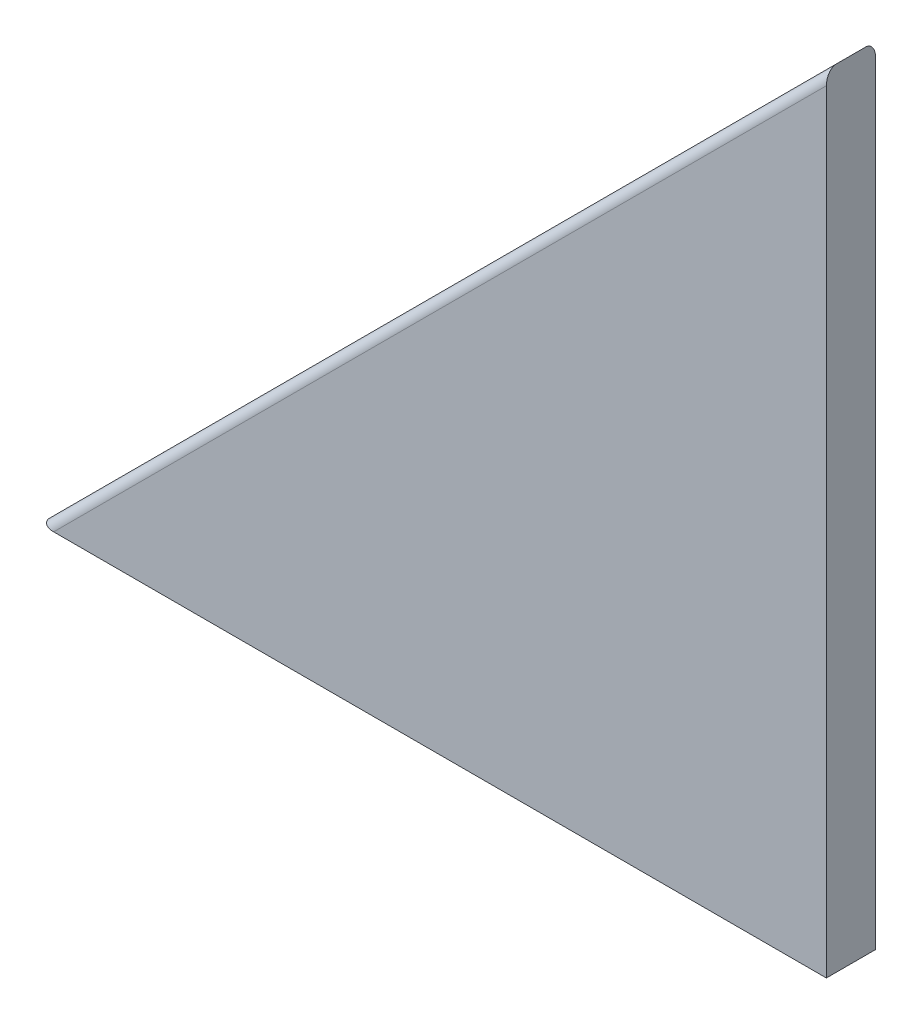
ISO-10303-21;
HEADER;
FILE_DESCRIPTION(('STEP AP214'),'2;1');
FILE_NAME('part.step','',(''),(''),'','','');
FILE_SCHEMA(('AUTOMOTIVE_DESIGN { 1 0 10303 214 1 1 1 1 }'));
ENDSEC;
DATA;
#1=APPLICATION_CONTEXT('core data for automotive mechanical design processes');
#2=APPLICATION_PROTOCOL_DEFINITION('international standard','automotive_design',2000,#1);
#3=PRODUCT_CONTEXT('',#1,'mechanical');
#4=PRODUCT('Part','Part','',(#3));
#5=PRODUCT_RELATED_PRODUCT_CATEGORY('part','',(#4));
#6=PRODUCT_DEFINITION_FORMATION('','',#4);
#7=PRODUCT_DEFINITION_CONTEXT('part definition',#1,'design');
#8=PRODUCT_DEFINITION('design','',#6,#7);
#9=PRODUCT_DEFINITION_SHAPE('','',#8);
#10=(LENGTH_UNIT() NAMED_UNIT(*) SI_UNIT(.MILLI.,.METRE.));
#11=(NAMED_UNIT(*) PLANE_ANGLE_UNIT() SI_UNIT($,.RADIAN.));
#12=(NAMED_UNIT(*) SI_UNIT($,.STERADIAN.) SOLID_ANGLE_UNIT());
#13=UNCERTAINTY_MEASURE_WITH_UNIT(LENGTH_MEASURE(1.E-05),#10,'distance_accuracy_value','');
#14=(GEOMETRIC_REPRESENTATION_CONTEXT(3) GLOBAL_UNCERTAINTY_ASSIGNED_CONTEXT((#13)) GLOBAL_UNIT_ASSIGNED_CONTEXT((#10,
#11,#12)) REPRESENTATION_CONTEXT('',''));
#15=CARTESIAN_POINT('',(0.,0.,0.));
#16=DIRECTION('',(0.,0.,1.));
#17=DIRECTION('',(1.,0.,0.));
#18=AXIS2_PLACEMENT_3D('',#15,#16,#17);
#19=CARTESIAN_POINT('',(0.,101.6,6.35));
#20=DIRECTION('',(-1.,0.,0.));
#21=DIRECTION('',(0.,0.,1.));
#22=AXIS2_PLACEMENT_3D('',#19,#20,#21);
#23=PLANE('',#22);
#24=DIRECTION('',(0.,1.,0.));
#25=VECTOR('',#24,1.);
#26=CARTESIAN_POINT('',(0.,101.6,0.));
#27=LINE('',#26,#25);
#28=CARTESIAN_POINT('',(0.,0.,0.));
#29=VERTEX_POINT('',#28);
#30=CARTESIAN_POINT('',(0.,99.8039487757862,0.));
#31=VERTEX_POINT('',#30);
#32=EDGE_CURVE('E123',#29,#31,#27,.T.);
#33=ORIENTED_EDGE('',*,*,#32,.T.);
#34=CARTESIAN_POINT('',(0.,99.8039487757862,1.27));
#35=DIRECTION('',(-1.,0.,0.));
#36=DIRECTION('',(0.,1.,0.));
#37=AXIS2_PLACEMENT_3D('',#34,#35,#36);
#38=ELLIPSE('',#37,1.79605122421383,1.27);
#39=CARTESIAN_POINT('',(0.,101.6,1.27));
#40=VERTEX_POINT('',#39);
#41=EDGE_CURVE('E11',#31,#40,#38,.F.);
#42=ORIENTED_EDGE('',*,*,#41,.T.);
#43=DIRECTION('',(0.,0.,-1.));
#44=VECTOR('',#43,1.);
#45=CARTESIAN_POINT('',(0.,101.6,6.35));
#46=LINE('',#45,#44);
#47=CARTESIAN_POINT('',(0.,101.6,5.08));
#48=VERTEX_POINT('',#47);
#49=EDGE_CURVE('E130',#48,#40,#46,.T.);
#50=ORIENTED_EDGE('',*,*,#49,.F.);
#51=CARTESIAN_POINT('',(0.,99.8039487757862,5.08));
#52=DIRECTION('',(-1.,0.,0.));
#53=DIRECTION('',(0.,-1.,0.));
#54=AXIS2_PLACEMENT_3D('',#51,#52,#53);
#55=ELLIPSE('',#54,1.79605122421383,1.27);
#56=CARTESIAN_POINT('',(0.,99.8039487757862,6.35));
#57=VERTEX_POINT('',#56);
#58=EDGE_CURVE('E117',#48,#57,#55,.F.);
#59=ORIENTED_EDGE('',*,*,#58,.T.);
#60=DIRECTION('',(0.,1.,0.));
#61=VECTOR('',#60,1.);
#62=CARTESIAN_POINT('',(0.,101.6,6.35));
#63=LINE('',#62,#61);
#64=CARTESIAN_POINT('',(0.,0.,6.35));
#65=VERTEX_POINT('',#64);
#66=EDGE_CURVE('E102',#65,#57,#63,.T.);
#67=ORIENTED_EDGE('',*,*,#66,.F.);
#68=DIRECTION('',(0.,0.,-1.));
#69=VECTOR('',#68,1.);
#70=CARTESIAN_POINT('',(0.,0.,6.35));
#71=LINE('',#70,#69);
#72=EDGE_CURVE('E106',#65,#29,#71,.T.);
#73=ORIENTED_EDGE('',*,*,#72,.T.);
#74=EDGE_LOOP('',(#33,#42,#50,#59,#67,#73));
#75=FACE_BOUND('',#74,.T.);
#76=ADVANCED_FACE('F40',(#75),#23,.F.);
#77=CARTESIAN_POINT('',(-101.6,0.,6.35));
#78=DIRECTION('',(0.707106781186548,-0.707106781186547,0.));
#79=DIRECTION('',(0.707106781186547,0.707106781186548,0.));
#80=AXIS2_PLACEMENT_3D('',#77,#78,#79);
#81=PLANE('',#80);
#82=ORIENTED_EDGE('',*,*,#49,.T.);
#83=DIRECTION('',(-0.707106781186547,-0.707106781186548,0.));
#84=VECTOR('',#83,1.);
#85=CARTESIAN_POINT('',(-101.6,0.,1.27));
#86=LINE('',#85,#84);
#87=CARTESIAN_POINT('',(-101.6,0.,1.27));
#88=VERTEX_POINT('',#87);
#89=EDGE_CURVE('E142',#40,#88,#86,.T.);
#90=ORIENTED_EDGE('',*,*,#89,.T.);
#91=DIRECTION('',(0.,0.,-1.));
#92=VECTOR('',#91,1.);
#93=CARTESIAN_POINT('',(-101.6,0.,6.35));
#94=LINE('',#93,#92);
#95=CARTESIAN_POINT('',(-101.6,0.,5.08));
#96=VERTEX_POINT('',#95);
#97=EDGE_CURVE('E113',#96,#88,#94,.T.);
#98=ORIENTED_EDGE('',*,*,#97,.F.);
#99=DIRECTION('',(-0.707106781186547,-0.707106781186548,0.));
#100=VECTOR('',#99,1.);
#101=CARTESIAN_POINT('',(-101.6,0.,5.08));
#102=LINE('',#101,#100);
#103=EDGE_CURVE('E139',#96,#48,#102,.F.);
#104=ORIENTED_EDGE('',*,*,#103,.T.);
#105=EDGE_LOOP('',(#82,#90,#98,#104));
#106=FACE_BOUND('',#105,.T.);
#107=ADVANCED_FACE('F151',(#106),#81,.F.);
#108=CARTESIAN_POINT('',(0.,0.,6.35));
#109=DIRECTION('',(0.,1.,0.));
#110=DIRECTION('',(-1.,0.,0.));
#111=AXIS2_PLACEMENT_3D('',#108,#109,#110);
#112=PLANE('',#111);
#113=ORIENTED_EDGE('',*,*,#97,.T.);
#114=CARTESIAN_POINT('',(-99.8039487757862,0.,1.27));
#115=DIRECTION('',(0.,1.,0.));
#116=DIRECTION('',(1.,0.,0.));
#117=AXIS2_PLACEMENT_3D('',#114,#115,#116);
#118=ELLIPSE('',#117,1.79605122421383,1.27);
#119=CARTESIAN_POINT('',(-99.8039487757862,0.,0.));
#120=VERTEX_POINT('',#119);
#121=EDGE_CURVE('E68',#88,#120,#118,.F.);
#122=ORIENTED_EDGE('',*,*,#121,.T.);
#123=DIRECTION('',(1.,0.,0.));
#124=VECTOR('',#123,1.);
#125=CARTESIAN_POINT('',(0.,0.,0.));
#126=LINE('',#125,#124);
#127=EDGE_CURVE('E110',#120,#29,#126,.T.);
#128=ORIENTED_EDGE('',*,*,#127,.T.);
#129=ORIENTED_EDGE('',*,*,#72,.F.);
#130=DIRECTION('',(1.,0.,0.));
#131=VECTOR('',#130,1.);
#132=CARTESIAN_POINT('',(0.,0.,6.35));
#133=LINE('',#132,#131);
#134=CARTESIAN_POINT('',(-99.8039487757862,0.,6.35));
#135=VERTEX_POINT('',#134);
#136=EDGE_CURVE('E98',#135,#65,#133,.T.);
#137=ORIENTED_EDGE('',*,*,#136,.F.);
#138=CARTESIAN_POINT('',(-99.8039487757862,0.,5.08));
#139=DIRECTION('',(0.,1.,0.));
#140=DIRECTION('',(-1.,0.,0.));
#141=AXIS2_PLACEMENT_3D('',#138,#139,#140);
#142=ELLIPSE('',#141,1.79605122421383,1.27);
#143=EDGE_CURVE('E136',#135,#96,#142,.F.);
#144=ORIENTED_EDGE('',*,*,#143,.T.);
#145=EDGE_LOOP('',(#113,#122,#128,#129,#137,#144));
#146=FACE_BOUND('',#145,.T.);
#147=ADVANCED_FACE('F109',(#146),#112,.F.);
#148=CARTESIAN_POINT('',(0.,0.,6.35));
#149=DIRECTION('',(0.,0.,-1.));
#150=DIRECTION('',(-1.,0.,0.));
#151=AXIS2_PLACEMENT_3D('',#148,#149,#150);
#152=PLANE('',#151);
#153=ORIENTED_EDGE('',*,*,#66,.T.);
#154=DIRECTION('',(-0.707106781186547,-0.707106781186548,0.));
#155=VECTOR('',#154,1.);
#156=CARTESIAN_POINT('',(-49.9019743878931,49.9019743878931,6.35));
#157=LINE('',#156,#155);
#158=EDGE_CURVE('E104',#57,#135,#157,.T.);
#159=ORIENTED_EDGE('',*,*,#158,.T.);
#160=ORIENTED_EDGE('',*,*,#136,.T.);
#161=EDGE_LOOP('',(#153,#159,#160));
#162=FACE_BOUND('',#161,.T.);
#163=ADVANCED_FACE('F100',(#162),#152,.F.);
#164=CARTESIAN_POINT('',(0.,0.,0.));
#165=DIRECTION('',(0.,0.,-1.));
#166=DIRECTION('',(-1.,0.,0.));
#167=AXIS2_PLACEMENT_3D('',#164,#165,#166);
#168=PLANE('',#167);
#169=ORIENTED_EDGE('',*,*,#127,.F.);
#170=DIRECTION('',(-0.707106781186547,-0.707106781186548,0.));
#171=VECTOR('',#170,1.);
#172=CARTESIAN_POINT('',(0.898025612106917,100.701974387893,0.));
#173=LINE('',#172,#171);
#174=EDGE_CURVE('E49',#120,#31,#173,.F.);
#175=ORIENTED_EDGE('',*,*,#174,.T.);
#176=ORIENTED_EDGE('',*,*,#32,.F.);
#177=EDGE_LOOP('',(#169,#175,#176));
#178=FACE_BOUND('',#177,.T.);
#179=ADVANCED_FACE('F161',(#178),#168,.T.);
#180=CARTESIAN_POINT('',(-49.9019743878931,49.9019743878931,5.08));
#181=DIRECTION('',(-0.707106781186547,-0.707106781186548,0.));
#182=DIRECTION('',(0.707106781186548,-0.707106781186547,0.));
#183=AXIS2_PLACEMENT_3D('',#180,#181,#182);
#184=CYLINDRICAL_SURFACE('',#183,1.27);
#185=ORIENTED_EDGE('',*,*,#58,.F.);
#186=ORIENTED_EDGE('',*,*,#103,.F.);
#187=ORIENTED_EDGE('',*,*,#143,.F.);
#188=ORIENTED_EDGE('',*,*,#158,.F.);
#189=EDGE_LOOP('',(#185,#186,#187,#188));
#190=FACE_BOUND('',#189,.T.);
#191=ADVANCED_FACE('F156',(#190),#184,.T.);
#192=CARTESIAN_POINT('',(-100.701974387893,-0.898025612106928,1.27));
#193=DIRECTION('',(0.707106781186547,0.707106781186548,0.));
#194=DIRECTION('',(-0.707106781186548,0.707106781186547,0.));
#195=AXIS2_PLACEMENT_3D('',#192,#193,#194);
#196=CYLINDRICAL_SURFACE('',#195,1.27);
#197=ORIENTED_EDGE('',*,*,#41,.F.);
#198=ORIENTED_EDGE('',*,*,#174,.F.);
#199=ORIENTED_EDGE('',*,*,#121,.F.);
#200=ORIENTED_EDGE('',*,*,#89,.F.);
#201=EDGE_LOOP('',(#197,#198,#199,#200));
#202=FACE_BOUND('',#201,.T.);
#203=ADVANCED_FACE('F42',(#202),#196,.T.);
#204=CLOSED_SHELL('',(#76,#107,#147,#163,#179,#191,#203));
#205=MANIFOLD_SOLID_BREP('B2',#204);
#206=ADVANCED_BREP_SHAPE_REPRESENTATION('',(#18,#205),#14);
#207=SHAPE_DEFINITION_REPRESENTATION(#9,#206);
ENDSEC;
END-ISO-10303-21;
